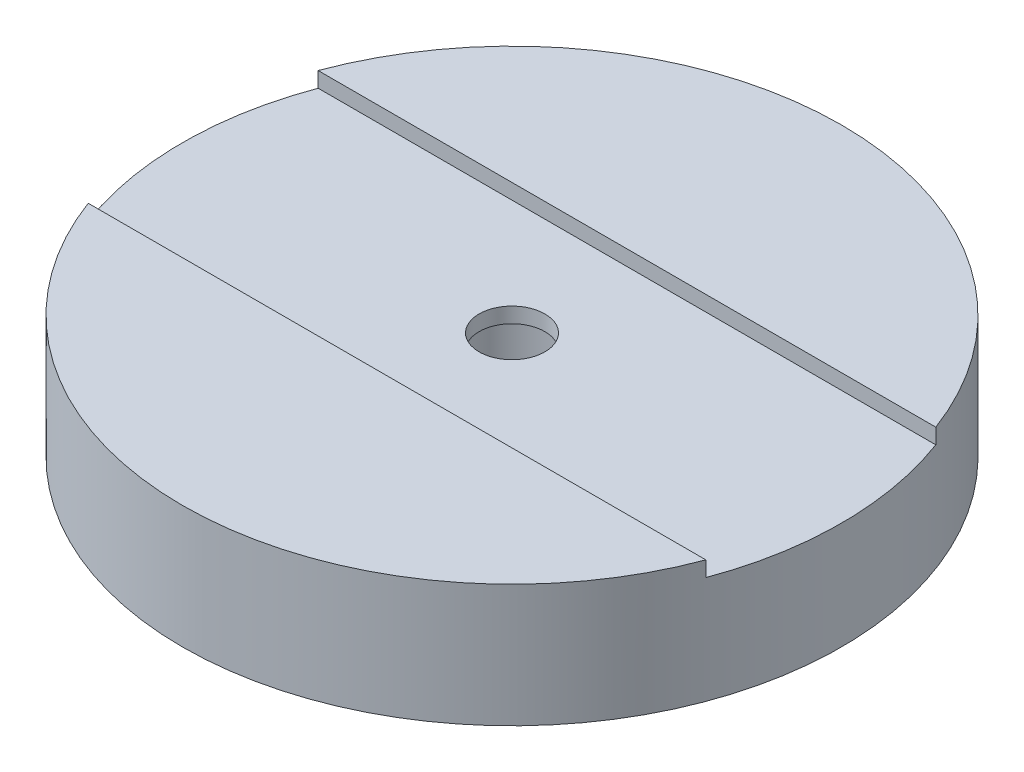
ISO-10303-21;
HEADER;
FILE_DESCRIPTION(('STEP AP214'),'2;1');
FILE_NAME('part.step','',(''),(''),'','','');
FILE_SCHEMA(('AUTOMOTIVE_DESIGN { 1 0 10303 214 1 1 1 1 }'));
ENDSEC;
DATA;
#1=APPLICATION_CONTEXT('core data for automotive mechanical design processes');
#2=APPLICATION_PROTOCOL_DEFINITION('international standard','automotive_design',2000,#1);
#3=PRODUCT_CONTEXT('',#1,'mechanical');
#4=PRODUCT('Part','Part','',(#3));
#5=PRODUCT_RELATED_PRODUCT_CATEGORY('part','',(#4));
#6=PRODUCT_DEFINITION_FORMATION('','',#4);
#7=PRODUCT_DEFINITION_CONTEXT('part definition',#1,'design');
#8=PRODUCT_DEFINITION('design','',#6,#7);
#9=PRODUCT_DEFINITION_SHAPE('','',#8);
#10=(LENGTH_UNIT() NAMED_UNIT(*) SI_UNIT(.MILLI.,.METRE.));
#11=(NAMED_UNIT(*) PLANE_ANGLE_UNIT() SI_UNIT($,.RADIAN.));
#12=(NAMED_UNIT(*) SI_UNIT($,.STERADIAN.) SOLID_ANGLE_UNIT());
#13=UNCERTAINTY_MEASURE_WITH_UNIT(LENGTH_MEASURE(1.E-05),#10,'distance_accuracy_value','');
#14=(GEOMETRIC_REPRESENTATION_CONTEXT(3) GLOBAL_UNCERTAINTY_ASSIGNED_CONTEXT((#13)) GLOBAL_UNIT_ASSIGNED_CONTEXT((#10,
#11,#12)) REPRESENTATION_CONTEXT('',''));
#15=CARTESIAN_POINT('',(0.,0.,0.));
#16=DIRECTION('',(0.,0.,1.));
#17=DIRECTION('',(1.,0.,0.));
#18=AXIS2_PLACEMENT_3D('',#15,#16,#17);
#19=CARTESIAN_POINT('',(0.,8.,0.));
#20=DIRECTION('',(0.,1.,0.));
#21=DIRECTION('',(0.,0.,1.));
#22=AXIS2_PLACEMENT_3D('',#19,#20,#21);
#23=PLANE('',#22);
#24=DIRECTION('',(-1.,0.,0.));
#25=VECTOR('',#24,1.);
#26=CARTESIAN_POINT('',(23.9896962479575,8.,-7.5));
#27=LINE('',#26,#25);
#28=CARTESIAN_POINT('',(20.1494416796099,8.,-7.5));
#29=VERTEX_POINT('',#28);
#30=CARTESIAN_POINT('',(-20.1494416796099,8.,-7.5));
#31=VERTEX_POINT('',#30);
#32=EDGE_CURVE('E85',#29,#31,#27,.T.);
#33=ORIENTED_EDGE('',*,*,#32,.F.);
#34=CARTESIAN_POINT('',(0.,8.,0.));
#35=DIRECTION('',(0.,1.,0.));
#36=DIRECTION('',(0.,0.,1.));
#37=AXIS2_PLACEMENT_3D('',#34,#35,#36);
#38=CIRCLE('',#37,21.5);
#39=EDGE_CURVE('E98',#29,#31,#38,.T.);
#40=ORIENTED_EDGE('',*,*,#39,.T.);
#41=EDGE_LOOP('',(#33,#40));
#42=FACE_BOUND('',#41,.T.);
#43=ADVANCED_FACE('F39',(#42),#23,.T.);
#44=CARTESIAN_POINT('',(0.,0.,0.));
#45=DIRECTION('',(0.,1.,0.));
#46=DIRECTION('',(0.,0.,1.));
#47=AXIS2_PLACEMENT_3D('',#44,#45,#46);
#48=PLANE('',#47);
#49=CARTESIAN_POINT('',(0.,0.,0.));
#50=DIRECTION('',(0.,1.,0.));
#51=DIRECTION('',(0.,0.,1.));
#52=AXIS2_PLACEMENT_3D('',#49,#50,#51);
#53=CIRCLE('',#52,21.5);
#54=CARTESIAN_POINT('',(0.,0.,21.5));
#55=VERTEX_POINT('',#54);
#56=EDGE_CURVE('E11',#55,#55,#53,.T.);
#57=ORIENTED_EDGE('',*,*,#56,.F.);
#58=EDGE_LOOP('',(#57));
#59=FACE_BOUND('',#58,.T.);
#60=CARTESIAN_POINT('',(0.,0.,0.));
#61=DIRECTION('',(0.,1.,0.));
#62=DIRECTION('',(0.,0.,1.));
#63=AXIS2_PLACEMENT_3D('',#60,#61,#62);
#64=CIRCLE('',#63,3.935);
#65=CARTESIAN_POINT('',(0.,0.,3.935));
#66=VERTEX_POINT('',#65);
#67=EDGE_CURVE('E49',#66,#66,#64,.T.);
#68=ORIENTED_EDGE('',*,*,#67,.T.);
#69=EDGE_LOOP('',(#68));
#70=FACE_BOUND('',#69,.T.);
#71=ADVANCED_FACE('F117',(#59,#70),#48,.F.);
#72=CARTESIAN_POINT('',(0.,6.,0.));
#73=DIRECTION('',(0.,-1.,0.));
#74=DIRECTION('',(0.,0.,-1.));
#75=AXIS2_PLACEMENT_3D('',#72,#73,#74);
#76=CYLINDRICAL_SURFACE('',#75,21.5);
#77=ORIENTED_EDGE('',*,*,#39,.F.);
#78=DIRECTION('',(0.,-1.,0.));
#79=VECTOR('',#78,1.);
#80=CARTESIAN_POINT('',(20.1494416796099,6.,-7.5));
#81=LINE('',#80,#79);
#82=CARTESIAN_POINT('',(20.1494416796099,7.,-7.5));
#83=VERTEX_POINT('',#82);
#84=EDGE_CURVE('E106',#29,#83,#81,.T.);
#85=ORIENTED_EDGE('',*,*,#84,.T.);
#86=CARTESIAN_POINT('',(0.,7.,0.));
#87=DIRECTION('',(0.,-1.,0.));
#88=DIRECTION('',(0.,0.,-1.));
#89=AXIS2_PLACEMENT_3D('',#86,#87,#88);
#90=CIRCLE('',#89,21.5);
#91=CARTESIAN_POINT('',(20.1494416796099,7.,7.5));
#92=VERTEX_POINT('',#91);
#93=EDGE_CURVE('E93',#83,#92,#90,.T.);
#94=ORIENTED_EDGE('',*,*,#93,.T.);
#95=DIRECTION('',(0.,-1.,0.));
#96=VECTOR('',#95,1.);
#97=CARTESIAN_POINT('',(20.1494416796099,6.,7.5));
#98=LINE('',#97,#96);
#99=CARTESIAN_POINT('',(20.1494416796099,8.,7.5));
#100=VERTEX_POINT('',#99);
#101=EDGE_CURVE('E61',#92,#100,#98,.F.);
#102=ORIENTED_EDGE('',*,*,#101,.T.);
#103=CARTESIAN_POINT('',(-20.1494416796099,8.,7.5));
#104=VERTEX_POINT('',#103);
#105=EDGE_CURVE('E91',#104,#100,#38,.T.);
#106=ORIENTED_EDGE('',*,*,#105,.F.);
#107=DIRECTION('',(0.,-1.,0.));
#108=VECTOR('',#107,1.);
#109=CARTESIAN_POINT('',(-20.1494416796099,6.,7.5));
#110=LINE('',#109,#108);
#111=CARTESIAN_POINT('',(-20.1494416796099,7.,7.5));
#112=VERTEX_POINT('',#111);
#113=EDGE_CURVE('E56',#104,#112,#110,.T.);
#114=ORIENTED_EDGE('',*,*,#113,.T.);
#115=CARTESIAN_POINT('',(-20.1494416796099,7.,-7.5));
#116=VERTEX_POINT('',#115);
#117=EDGE_CURVE('E167',#112,#116,#90,.T.);
#118=ORIENTED_EDGE('',*,*,#117,.T.);
#119=DIRECTION('',(0.,-1.,0.));
#120=VECTOR('',#119,1.);
#121=CARTESIAN_POINT('',(-20.1494416796099,6.,-7.5));
#122=LINE('',#121,#120);
#123=EDGE_CURVE('E172',#116,#31,#122,.F.);
#124=ORIENTED_EDGE('',*,*,#123,.T.);
#125=EDGE_LOOP('',(#77,#85,#94,#102,#106,#114,#118,#124));
#126=FACE_BOUND('',#125,.T.);
#127=ORIENTED_EDGE('',*,*,#56,.T.);
#128=EDGE_LOOP('',(#127));
#129=FACE_BOUND('',#128,.T.);
#130=ADVANCED_FACE('F41',(#126,#129),#76,.T.);
#131=CARTESIAN_POINT('',(0.,6.,0.));
#132=DIRECTION('',(0.,-1.,0.));
#133=DIRECTION('',(0.,0.,-1.));
#134=AXIS2_PLACEMENT_3D('',#131,#132,#133);
#135=CYLINDRICAL_SURFACE('',#134,3.935);
#136=CARTESIAN_POINT('',(0.,6.,0.));
#137=DIRECTION('',(0.,1.,0.));
#138=DIRECTION('',(0.,0.,1.));
#139=AXIS2_PLACEMENT_3D('',#136,#137,#138);
#140=CIRCLE('',#139,3.935);
#141=CARTESIAN_POINT('',(0.,6.,3.935));
#142=VERTEX_POINT('',#141);
#143=EDGE_CURVE('E104',#142,#142,#140,.T.);
#144=ORIENTED_EDGE('',*,*,#143,.T.);
#145=EDGE_LOOP('',(#144));
#146=FACE_BOUND('',#145,.T.);
#147=ORIENTED_EDGE('',*,*,#67,.F.);
#148=EDGE_LOOP('',(#147));
#149=FACE_BOUND('',#148,.T.);
#150=ADVANCED_FACE('F119',(#146,#149),#135,.F.);
#151=CARTESIAN_POINT('',(0.,6.,0.));
#152=DIRECTION('',(0.,1.,0.));
#153=DIRECTION('',(0.,0.,1.));
#154=AXIS2_PLACEMENT_3D('',#151,#152,#153);
#155=PLANE('',#154);
#156=CARTESIAN_POINT('',(0.,6.,0.));
#157=DIRECTION('',(0.,1.,0.));
#158=DIRECTION('',(0.,0.,1.));
#159=AXIS2_PLACEMENT_3D('',#156,#157,#158);
#160=CIRCLE('',#159,2.14617077650203);
#161=CARTESIAN_POINT('',(0.,6.,2.14617077650203));
#162=VERTEX_POINT('',#161);
#163=EDGE_CURVE('E99',#162,#162,#160,.T.);
#164=ORIENTED_EDGE('',*,*,#163,.T.);
#165=EDGE_LOOP('',(#164));
#166=FACE_BOUND('',#165,.T.);
#167=ORIENTED_EDGE('',*,*,#143,.F.);
#168=EDGE_LOOP('',(#167));
#169=FACE_BOUND('',#168,.T.);
#170=ADVANCED_FACE('F121',(#166,#169),#155,.F.);
#171=DIRECTION('',(1.,0.,0.));
#172=VECTOR('',#171,1.);
#173=CARTESIAN_POINT('',(23.9896962479575,8.,7.5));
#174=LINE('',#173,#172);
#175=EDGE_CURVE('E79',#104,#100,#174,.T.);
#176=ORIENTED_EDGE('',*,*,#175,.F.);
#177=ORIENTED_EDGE('',*,*,#105,.T.);
#178=EDGE_LOOP('',(#176,#177));
#179=FACE_BOUND('',#178,.T.);
#180=ADVANCED_FACE('F96',(#179),#23,.T.);
#181=CARTESIAN_POINT('',(0.,8.,0.));
#182=DIRECTION('',(0.,-1.,0.));
#183=DIRECTION('',(0.,0.,-1.));
#184=AXIS2_PLACEMENT_3D('',#181,#182,#183);
#185=CYLINDRICAL_SURFACE('',#184,2.14617077650203);
#186=CARTESIAN_POINT('',(0.,7.,0.));
#187=DIRECTION('',(0.,-1.,0.));
#188=DIRECTION('',(0.,0.,-1.));
#189=AXIS2_PLACEMENT_3D('',#186,#187,#188);
#190=CIRCLE('',#189,2.14617077650203);
#191=CARTESIAN_POINT('',(0.,7.,-2.14617077650203));
#192=VERTEX_POINT('',#191);
#193=EDGE_CURVE('E43',#192,#192,#190,.T.);
#194=ORIENTED_EDGE('',*,*,#193,.F.);
#195=EDGE_LOOP('',(#194));
#196=FACE_BOUND('',#195,.T.);
#197=ORIENTED_EDGE('',*,*,#163,.F.);
#198=EDGE_LOOP('',(#197));
#199=FACE_BOUND('',#198,.T.);
#200=ADVANCED_FACE('F140',(#196,#199),#185,.F.);
#201=CARTESIAN_POINT('',(23.9896962479575,7.,-7.5));
#202=DIRECTION('',(0.,0.,-1.));
#203=DIRECTION('',(-1.,0.,0.));
#204=AXIS2_PLACEMENT_3D('',#201,#202,#203);
#205=PLANE('',#204);
#206=ORIENTED_EDGE('',*,*,#32,.T.);
#207=ORIENTED_EDGE('',*,*,#123,.F.);
#208=DIRECTION('',(-1.,0.,0.));
#209=VECTOR('',#208,1.);
#210=CARTESIAN_POINT('',(23.9896962479575,7.,-7.5));
#211=LINE('',#210,#209);
#212=EDGE_CURVE('E165',#83,#116,#211,.T.);
#213=ORIENTED_EDGE('',*,*,#212,.F.);
#214=ORIENTED_EDGE('',*,*,#84,.F.);
#215=EDGE_LOOP('',(#206,#207,#213,#214));
#216=FACE_BOUND('',#215,.T.);
#217=ADVANCED_FACE('F144',(#216),#205,.F.);
#218=CARTESIAN_POINT('',(23.9896962479575,7.,7.5));
#219=DIRECTION('',(0.,0.,1.));
#220=DIRECTION('',(1.,0.,0.));
#221=AXIS2_PLACEMENT_3D('',#218,#219,#220);
#222=PLANE('',#221);
#223=ORIENTED_EDGE('',*,*,#175,.T.);
#224=ORIENTED_EDGE('',*,*,#101,.F.);
#225=DIRECTION('',(1.,0.,0.));
#226=VECTOR('',#225,1.);
#227=CARTESIAN_POINT('',(23.9896962479575,7.,7.5));
#228=LINE('',#227,#226);
#229=EDGE_CURVE('E169',#112,#92,#228,.T.);
#230=ORIENTED_EDGE('',*,*,#229,.F.);
#231=ORIENTED_EDGE('',*,*,#113,.F.);
#232=EDGE_LOOP('',(#223,#224,#230,#231));
#233=FACE_BOUND('',#232,.T.);
#234=ADVANCED_FACE('F80',(#233),#222,.F.);
#235=CARTESIAN_POINT('',(0.,7.,0.));
#236=DIRECTION('',(0.,-1.,0.));
#237=DIRECTION('',(0.,0.,-1.));
#238=AXIS2_PLACEMENT_3D('',#235,#236,#237);
#239=PLANE('',#238);
#240=ORIENTED_EDGE('',*,*,#193,.T.);
#241=EDGE_LOOP('',(#240));
#242=FACE_BOUND('',#241,.T.);
#243=ORIENTED_EDGE('',*,*,#212,.T.);
#244=ORIENTED_EDGE('',*,*,#117,.F.);
#245=ORIENTED_EDGE('',*,*,#229,.T.);
#246=ORIENTED_EDGE('',*,*,#93,.F.);
#247=EDGE_LOOP('',(#243,#244,#245,#246));
#248=FACE_BOUND('',#247,.T.);
#249=ADVANCED_FACE('F155',(#242,#248),#239,.F.);
#250=CLOSED_SHELL('',(#43,#71,#130,#150,#170,#180,#200,#217,#234,#249));
#251=MANIFOLD_SOLID_BREP('B2',#250);
#252=ADVANCED_BREP_SHAPE_REPRESENTATION('',(#18,#251),#14);
#253=SHAPE_DEFINITION_REPRESENTATION(#9,#252);
ENDSEC;
END-ISO-10303-21;
